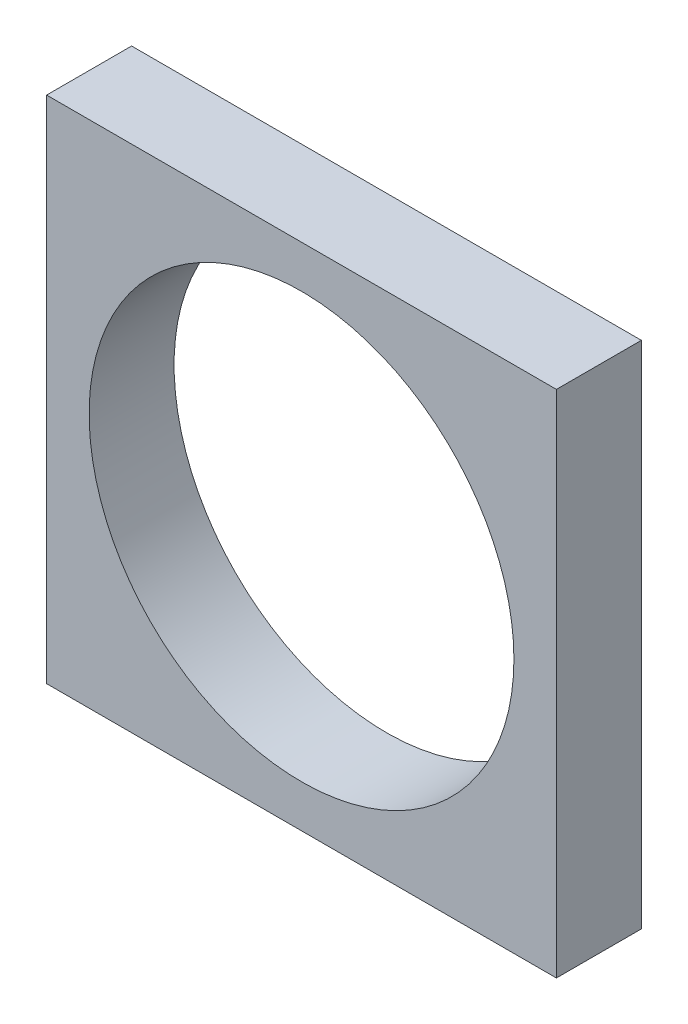
ISO-10303-21;
HEADER;
FILE_DESCRIPTION(('STEP AP214'),'2;1');
FILE_NAME('part.step','',(''),(''),'','','');
FILE_SCHEMA(('AUTOMOTIVE_DESIGN { 1 0 10303 214 1 1 1 1 }'));
ENDSEC;
DATA;
#1=APPLICATION_CONTEXT('core data for automotive mechanical design processes');
#2=APPLICATION_PROTOCOL_DEFINITION('international standard','automotive_design',2000,#1);
#3=PRODUCT_CONTEXT('',#1,'mechanical');
#4=PRODUCT('Part','Part','',(#3));
#5=PRODUCT_RELATED_PRODUCT_CATEGORY('part','',(#4));
#6=PRODUCT_DEFINITION_FORMATION('','',#4);
#7=PRODUCT_DEFINITION_CONTEXT('part definition',#1,'design');
#8=PRODUCT_DEFINITION('design','',#6,#7);
#9=PRODUCT_DEFINITION_SHAPE('','',#8);
#10=(LENGTH_UNIT() NAMED_UNIT(*) SI_UNIT(.MILLI.,.METRE.));
#11=(NAMED_UNIT(*) PLANE_ANGLE_UNIT() SI_UNIT($,.RADIAN.));
#12=(NAMED_UNIT(*) SI_UNIT($,.STERADIAN.) SOLID_ANGLE_UNIT());
#13=UNCERTAINTY_MEASURE_WITH_UNIT(LENGTH_MEASURE(1.E-05),#10,'distance_accuracy_value','');
#14=(GEOMETRIC_REPRESENTATION_CONTEXT(3) GLOBAL_UNCERTAINTY_ASSIGNED_CONTEXT((#13)) GLOBAL_UNIT_ASSIGNED_CONTEXT((#10,
#11,#12)) REPRESENTATION_CONTEXT('',''));
#15=CARTESIAN_POINT('',(0.,0.,0.));
#16=DIRECTION('',(0.,0.,1.));
#17=DIRECTION('',(1.,0.,0.));
#18=AXIS2_PLACEMENT_3D('',#15,#16,#17);
#19=CARTESIAN_POINT('',(0.,0.,10.));
#20=DIRECTION('',(0.,0.,1.));
#21=DIRECTION('',(1.,0.,0.));
#22=AXIS2_PLACEMENT_3D('',#19,#20,#21);
#23=PLANE('',#22);
#24=DIRECTION('',(0.,-1.,0.));
#25=VECTOR('',#24,1.);
#26=CARTESIAN_POINT('',(-30.,30.,10.));
#27=LINE('',#26,#25);
#28=CARTESIAN_POINT('',(-30.,30.,10.));
#29=VERTEX_POINT('',#28);
#30=CARTESIAN_POINT('',(-30.,-30.,10.));
#31=VERTEX_POINT('',#30);
#32=EDGE_CURVE('E85',#29,#31,#27,.T.);
#33=ORIENTED_EDGE('',*,*,#32,.T.);
#34=DIRECTION('',(1.,0.,0.));
#35=VECTOR('',#34,1.);
#36=CARTESIAN_POINT('',(-30.,-30.,10.));
#37=LINE('',#36,#35);
#38=CARTESIAN_POINT('',(30.,-30.,10.));
#39=VERTEX_POINT('',#38);
#40=EDGE_CURVE('E80',#31,#39,#37,.T.);
#41=ORIENTED_EDGE('',*,*,#40,.T.);
#42=DIRECTION('',(0.,1.,0.));
#43=VECTOR('',#42,1.);
#44=CARTESIAN_POINT('',(30.,30.,10.));
#45=LINE('',#44,#43);
#46=CARTESIAN_POINT('',(30.,30.,10.));
#47=VERTEX_POINT('',#46);
#48=EDGE_CURVE('E83',#39,#47,#45,.T.);
#49=ORIENTED_EDGE('',*,*,#48,.T.);
#50=DIRECTION('',(-1.,0.,0.));
#51=VECTOR('',#50,1.);
#52=CARTESIAN_POINT('',(-30.,30.,10.));
#53=LINE('',#52,#51);
#54=EDGE_CURVE('E50',#47,#29,#53,.T.);
#55=ORIENTED_EDGE('',*,*,#54,.T.);
#56=EDGE_LOOP('',(#33,#41,#49,#55));
#57=FACE_BOUND('',#56,.T.);
#58=CARTESIAN_POINT('',(0.,0.,10.));
#59=DIRECTION('',(0.,0.,1.));
#60=DIRECTION('',(1.,0.,0.));
#61=AXIS2_PLACEMENT_3D('',#58,#59,#60);
#62=CIRCLE('',#61,25.);
#63=CARTESIAN_POINT('',(25.,0.,10.));
#64=VERTEX_POINT('',#63);
#65=EDGE_CURVE('E100',#64,#64,#62,.T.);
#66=ORIENTED_EDGE('',*,*,#65,.F.);
#67=EDGE_LOOP('',(#66));
#68=FACE_BOUND('',#67,.T.);
#69=ADVANCED_FACE('F33',(#57,#68),#23,.T.);
#70=CARTESIAN_POINT('',(0.,0.,0.));
#71=DIRECTION('',(0.,0.,1.));
#72=DIRECTION('',(1.,0.,0.));
#73=AXIS2_PLACEMENT_3D('',#70,#71,#72);
#74=PLANE('',#73);
#75=DIRECTION('',(0.,-1.,0.));
#76=VECTOR('',#75,1.);
#77=CARTESIAN_POINT('',(-30.,30.,0.));
#78=LINE('',#77,#76);
#79=CARTESIAN_POINT('',(-30.,30.,0.));
#80=VERTEX_POINT('',#79);
#81=CARTESIAN_POINT('',(-30.,-30.,0.));
#82=VERTEX_POINT('',#81);
#83=EDGE_CURVE('E97',#80,#82,#78,.T.);
#84=ORIENTED_EDGE('',*,*,#83,.F.);
#85=DIRECTION('',(-1.,0.,0.));
#86=VECTOR('',#85,1.);
#87=CARTESIAN_POINT('',(-30.,30.,0.));
#88=LINE('',#87,#86);
#89=CARTESIAN_POINT('',(30.,30.,0.));
#90=VERTEX_POINT('',#89);
#91=EDGE_CURVE('E73',#90,#80,#88,.T.);
#92=ORIENTED_EDGE('',*,*,#91,.F.);
#93=DIRECTION('',(0.,1.,0.));
#94=VECTOR('',#93,1.);
#95=CARTESIAN_POINT('',(30.,30.,0.));
#96=LINE('',#95,#94);
#97=CARTESIAN_POINT('',(30.,-30.,0.));
#98=VERTEX_POINT('',#97);
#99=EDGE_CURVE('E67',#98,#90,#96,.T.);
#100=ORIENTED_EDGE('',*,*,#99,.F.);
#101=DIRECTION('',(1.,0.,0.));
#102=VECTOR('',#101,1.);
#103=CARTESIAN_POINT('',(-30.,-30.,0.));
#104=LINE('',#103,#102);
#105=EDGE_CURVE('E89',#82,#98,#104,.T.);
#106=ORIENTED_EDGE('',*,*,#105,.F.);
#107=EDGE_LOOP('',(#84,#92,#100,#106));
#108=FACE_BOUND('',#107,.T.);
#109=CARTESIAN_POINT('',(0.,0.,0.));
#110=DIRECTION('',(0.,0.,1.));
#111=DIRECTION('',(1.,0.,0.));
#112=AXIS2_PLACEMENT_3D('',#109,#110,#111);
#113=CIRCLE('',#112,25.);
#114=CARTESIAN_POINT('',(25.,0.,0.));
#115=VERTEX_POINT('',#114);
#116=EDGE_CURVE('E112',#115,#115,#113,.T.);
#117=ORIENTED_EDGE('',*,*,#116,.T.);
#118=EDGE_LOOP('',(#117));
#119=FACE_BOUND('',#118,.T.);
#120=ADVANCED_FACE('F108',(#108,#119),#74,.F.);
#121=CARTESIAN_POINT('',(-30.,30.,10.));
#122=DIRECTION('',(1.,0.,0.));
#123=DIRECTION('',(0.,1.,0.));
#124=AXIS2_PLACEMENT_3D('',#121,#122,#123);
#125=PLANE('',#124);
#126=ORIENTED_EDGE('',*,*,#83,.T.);
#127=DIRECTION('',(0.,0.,-1.));
#128=VECTOR('',#127,1.);
#129=CARTESIAN_POINT('',(-30.,-30.,10.));
#130=LINE('',#129,#128);
#131=EDGE_CURVE('E11',#31,#82,#130,.T.);
#132=ORIENTED_EDGE('',*,*,#131,.F.);
#133=ORIENTED_EDGE('',*,*,#32,.F.);
#134=DIRECTION('',(0.,0.,-1.));
#135=VECTOR('',#134,1.);
#136=CARTESIAN_POINT('',(-30.,30.,10.));
#137=LINE('',#136,#135);
#138=EDGE_CURVE('E93',#29,#80,#137,.T.);
#139=ORIENTED_EDGE('',*,*,#138,.T.);
#140=EDGE_LOOP('',(#126,#132,#133,#139));
#141=FACE_BOUND('',#140,.T.);
#142=ADVANCED_FACE('F35',(#141),#125,.F.);
#143=CARTESIAN_POINT('',(-30.,-30.,10.));
#144=DIRECTION('',(0.,1.,0.));
#145=DIRECTION('',(0.,0.,1.));
#146=AXIS2_PLACEMENT_3D('',#143,#144,#145);
#147=PLANE('',#146);
#148=ORIENTED_EDGE('',*,*,#105,.T.);
#149=DIRECTION('',(0.,0.,-1.));
#150=VECTOR('',#149,1.);
#151=CARTESIAN_POINT('',(30.,-30.,10.));
#152=LINE('',#151,#150);
#153=EDGE_CURVE('E42',#39,#98,#152,.T.);
#154=ORIENTED_EDGE('',*,*,#153,.F.);
#155=ORIENTED_EDGE('',*,*,#40,.F.);
#156=ORIENTED_EDGE('',*,*,#131,.T.);
#157=EDGE_LOOP('',(#148,#154,#155,#156));
#158=FACE_BOUND('',#157,.T.);
#159=ADVANCED_FACE('F88',(#158),#147,.F.);
#160=CARTESIAN_POINT('',(30.,30.,10.));
#161=DIRECTION('',(-1.,0.,0.));
#162=DIRECTION('',(0.,0.,1.));
#163=AXIS2_PLACEMENT_3D('',#160,#161,#162);
#164=PLANE('',#163);
#165=ORIENTED_EDGE('',*,*,#99,.T.);
#166=DIRECTION('',(0.,0.,-1.));
#167=VECTOR('',#166,1.);
#168=CARTESIAN_POINT('',(30.,30.,10.));
#169=LINE('',#168,#167);
#170=EDGE_CURVE('E90',#47,#90,#169,.T.);
#171=ORIENTED_EDGE('',*,*,#170,.F.);
#172=ORIENTED_EDGE('',*,*,#48,.F.);
#173=ORIENTED_EDGE('',*,*,#153,.T.);
#174=EDGE_LOOP('',(#165,#171,#172,#173));
#175=FACE_BOUND('',#174,.T.);
#176=ADVANCED_FACE('F91',(#175),#164,.F.);
#177=CARTESIAN_POINT('',(-30.,30.,10.));
#178=DIRECTION('',(0.,-1.,0.));
#179=DIRECTION('',(0.,0.,-1.));
#180=AXIS2_PLACEMENT_3D('',#177,#178,#179);
#181=PLANE('',#180);
#182=ORIENTED_EDGE('',*,*,#91,.T.);
#183=ORIENTED_EDGE('',*,*,#138,.F.);
#184=ORIENTED_EDGE('',*,*,#54,.F.);
#185=ORIENTED_EDGE('',*,*,#170,.T.);
#186=EDGE_LOOP('',(#182,#183,#184,#185));
#187=FACE_BOUND('',#186,.T.);
#188=ADVANCED_FACE('F105',(#187),#181,.F.);
#189=CARTESIAN_POINT('',(0.,0.,10.));
#190=DIRECTION('',(0.,0.,-1.));
#191=DIRECTION('',(-1.,0.,0.));
#192=AXIS2_PLACEMENT_3D('',#189,#190,#191);
#193=CYLINDRICAL_SURFACE('',#192,25.);
#194=ORIENTED_EDGE('',*,*,#65,.T.);
#195=EDGE_LOOP('',(#194));
#196=FACE_BOUND('',#195,.T.);
#197=ORIENTED_EDGE('',*,*,#116,.F.);
#198=EDGE_LOOP('',(#197));
#199=FACE_BOUND('',#198,.T.);
#200=ADVANCED_FACE('F118',(#196,#199),#193,.F.);
#201=CLOSED_SHELL('',(#69,#120,#142,#159,#176,#188,#200));
#202=MANIFOLD_SOLID_BREP('B2',#201);
#203=ADVANCED_BREP_SHAPE_REPRESENTATION('',(#18,#202),#14);
#204=SHAPE_DEFINITION_REPRESENTATION(#9,#203);
ENDSEC;
END-ISO-10303-21;
